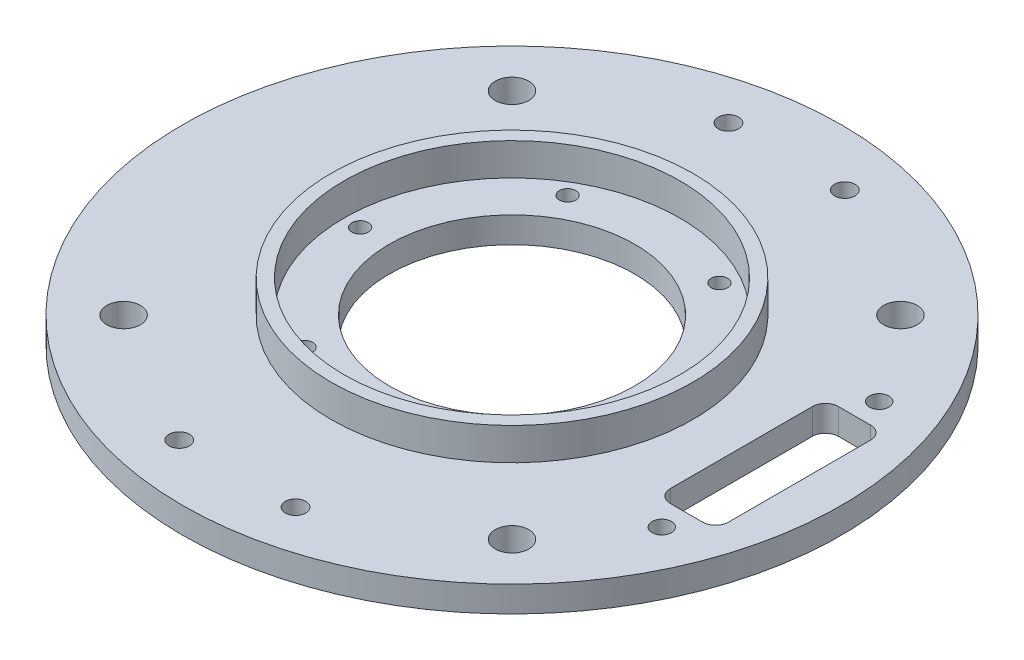
ISO-10303-21;
HEADER;
FILE_DESCRIPTION(('STEP AP214'),'2;1');
FILE_NAME('part.step','',(''),(''),'','','');
FILE_SCHEMA(('AUTOMOTIVE_DESIGN { 1 0 10303 214 1 1 1 1 }'));
ENDSEC;
DATA;
#1=APPLICATION_CONTEXT('core data for automotive mechanical design processes');
#2=APPLICATION_PROTOCOL_DEFINITION('international standard','automotive_design',2000,#1);
#3=PRODUCT_CONTEXT('',#1,'mechanical');
#4=PRODUCT('Part','Part','',(#3));
#5=PRODUCT_RELATED_PRODUCT_CATEGORY('part','',(#4));
#6=PRODUCT_DEFINITION_FORMATION('','',#4);
#7=PRODUCT_DEFINITION_CONTEXT('part definition',#1,'design');
#8=PRODUCT_DEFINITION('design','',#6,#7);
#9=PRODUCT_DEFINITION_SHAPE('','',#8);
#10=(LENGTH_UNIT() NAMED_UNIT(*) SI_UNIT(.MILLI.,.METRE.));
#11=(NAMED_UNIT(*) PLANE_ANGLE_UNIT() SI_UNIT($,.RADIAN.));
#12=(NAMED_UNIT(*) SI_UNIT($,.STERADIAN.) SOLID_ANGLE_UNIT());
#13=UNCERTAINTY_MEASURE_WITH_UNIT(LENGTH_MEASURE(1.E-05),#10,'distance_accuracy_value','');
#14=(GEOMETRIC_REPRESENTATION_CONTEXT(3) GLOBAL_UNCERTAINTY_ASSIGNED_CONTEXT((#13)) GLOBAL_UNIT_ASSIGNED_CONTEXT((#10,
#11,#12)) REPRESENTATION_CONTEXT('',''));
#15=CARTESIAN_POINT('',(0.,0.,0.));
#16=DIRECTION('',(0.,0.,1.));
#17=DIRECTION('',(1.,0.,0.));
#18=AXIS2_PLACEMENT_3D('',#15,#16,#17);
#19=CARTESIAN_POINT('',(0.,4.,0.));
#20=DIRECTION('',(0.,1.,0.));
#21=DIRECTION('',(0.,0.,1.));
#22=AXIS2_PLACEMENT_3D('',#19,#20,#21);
#23=PLANE('',#22);
#24=CARTESIAN_POINT('',(0.,4.,0.));
#25=DIRECTION('',(0.,1.,0.));
#26=DIRECTION('',(0.,0.,1.));
#27=AXIS2_PLACEMENT_3D('',#24,#25,#26);
#28=CIRCLE('',#27,19.);
#29=CARTESIAN_POINT('',(0.,4.,19.));
#30=VERTEX_POINT('',#29);
#31=EDGE_CURVE('E213',#30,#30,#28,.T.);
#32=ORIENTED_EDGE('',*,*,#31,.F.);
#33=EDGE_LOOP('',(#32));
#34=FACE_BOUND('',#33,.T.);
#35=CARTESIAN_POINT('',(23.5,4.,0.));
#36=DIRECTION('',(0.,1.,0.));
#37=DIRECTION('',(0.,0.,1.));
#38=AXIS2_PLACEMENT_3D('',#35,#36,#37);
#39=CIRCLE('',#38,1.275);
#40=CARTESIAN_POINT('',(23.5,4.,1.275));
#41=VERTEX_POINT('',#40);
#42=EDGE_CURVE('E206',#41,#41,#39,.T.);
#43=ORIENTED_EDGE('',*,*,#42,.F.);
#44=EDGE_LOOP('',(#43));
#45=FACE_BOUND('',#44,.T.);
#46=CARTESIAN_POINT('',(11.75,4.,-20.3515969889343));
#47=DIRECTION('',(0.,1.,0.));
#48=DIRECTION('',(0.,0.,1.));
#49=AXIS2_PLACEMENT_3D('',#46,#47,#48);
#50=CIRCLE('',#49,1.275);
#51=CARTESIAN_POINT('',(11.75,4.,-19.0765969889343));
#52=VERTEX_POINT('',#51);
#53=EDGE_CURVE('E202',#52,#52,#50,.T.);
#54=ORIENTED_EDGE('',*,*,#53,.F.);
#55=EDGE_LOOP('',(#54));
#56=FACE_BOUND('',#55,.T.);
#57=CARTESIAN_POINT('',(-11.7500000000001,4.,-20.3515969889343));
#58=DIRECTION('',(0.,1.,0.));
#59=DIRECTION('',(0.,0.,1.));
#60=AXIS2_PLACEMENT_3D('',#57,#58,#59);
#61=CIRCLE('',#60,1.275);
#62=CARTESIAN_POINT('',(-11.7500000000001,4.,-19.0765969889343));
#63=VERTEX_POINT('',#62);
#64=EDGE_CURVE('E196',#63,#63,#61,.T.);
#65=ORIENTED_EDGE('',*,*,#64,.F.);
#66=EDGE_LOOP('',(#65));
#67=FACE_BOUND('',#66,.T.);
#68=CARTESIAN_POINT('',(-23.5,4.,0.));
#69=DIRECTION('',(0.,1.,0.));
#70=DIRECTION('',(0.,0.,1.));
#71=AXIS2_PLACEMENT_3D('',#68,#69,#70);
#72=CIRCLE('',#71,1.275);
#73=CARTESIAN_POINT('',(-23.5,4.,1.275));
#74=VERTEX_POINT('',#73);
#75=EDGE_CURVE('E190',#74,#74,#72,.T.);
#76=ORIENTED_EDGE('',*,*,#75,.F.);
#77=EDGE_LOOP('',(#76));
#78=FACE_BOUND('',#77,.T.);
#79=CARTESIAN_POINT('',(-11.7499999999998,4.,20.3515969889344));
#80=DIRECTION('',(0.,1.,0.));
#81=DIRECTION('',(0.,0.,1.));
#82=AXIS2_PLACEMENT_3D('',#79,#80,#81);
#83=CIRCLE('',#82,1.275);
#84=CARTESIAN_POINT('',(-11.7499999999998,4.,21.6265969889344));
#85=VERTEX_POINT('',#84);
#86=EDGE_CURVE('E184',#85,#85,#83,.T.);
#87=ORIENTED_EDGE('',*,*,#86,.F.);
#88=EDGE_LOOP('',(#87));
#89=FACE_BOUND('',#88,.T.);
#90=CARTESIAN_POINT('',(11.7500000000002,4.,20.3515969889342));
#91=DIRECTION('',(0.,1.,0.));
#92=DIRECTION('',(0.,0.,1.));
#93=AXIS2_PLACEMENT_3D('',#90,#91,#92);
#94=CIRCLE('',#93,1.275);
#95=CARTESIAN_POINT('',(11.7500000000002,4.,21.6265969889342));
#96=VERTEX_POINT('',#95);
#97=EDGE_CURVE('E178',#96,#96,#94,.T.);
#98=ORIENTED_EDGE('',*,*,#97,.F.);
#99=EDGE_LOOP('',(#98));
#100=FACE_BOUND('',#99,.T.);
#101=CARTESIAN_POINT('',(0.,4.,0.));
#102=DIRECTION('',(0.,1.,0.));
#103=DIRECTION('',(0.,0.,1.));
#104=AXIS2_PLACEMENT_3D('',#101,#102,#103);
#105=CIRCLE('',#104,26.);
#106=CARTESIAN_POINT('',(0.,4.,26.));
#107=VERTEX_POINT('',#106);
#108=EDGE_CURVE('E144',#107,#107,#105,.T.);
#109=ORIENTED_EDGE('',*,*,#108,.T.);
#110=EDGE_LOOP('',(#109));
#111=FACE_BOUND('',#110,.T.);
#112=ADVANCED_FACE('F35',(#34,#45,#56,#67,#78,#89,#100,#111),#23,.T.);
#113=CARTESIAN_POINT('',(-30.0520382004286,4.,30.0520382004279));
#114=DIRECTION('',(0.,1.,0.));
#115=DIRECTION('',(0.,0.,1.));
#116=AXIS2_PLACEMENT_3D('',#113,#114,#115);
#117=CIRCLE('',#116,2.6);
#118=CARTESIAN_POINT('',(-30.0520382004286,4.,32.6520382004279));
#119=VERTEX_POINT('',#118);
#120=EDGE_CURVE('E371',#119,#119,#117,.T.);
#121=ORIENTED_EDGE('',*,*,#120,.F.);
#122=EDGE_LOOP('',(#121));
#123=FACE_BOUND('',#122,.T.);
#124=CARTESIAN_POINT('',(30.0520382004282,4.,30.0520382004283));
#125=DIRECTION('',(0.,1.,0.));
#126=DIRECTION('',(0.,0.,1.));
#127=AXIS2_PLACEMENT_3D('',#124,#125,#126);
#128=CIRCLE('',#127,2.6);
#129=CARTESIAN_POINT('',(30.0520382004282,4.,32.6520382004283));
#130=VERTEX_POINT('',#129);
#131=EDGE_CURVE('E258',#130,#130,#128,.T.);
#132=ORIENTED_EDGE('',*,*,#131,.F.);
#133=EDGE_LOOP('',(#132));
#134=FACE_BOUND('',#133,.T.);
#135=CARTESIAN_POINT('',(30.0520382004284,4.,-30.0520382004281));
#136=DIRECTION('',(0.,1.,0.));
#137=DIRECTION('',(0.,0.,1.));
#138=AXIS2_PLACEMENT_3D('',#135,#136,#137);
#139=CIRCLE('',#138,2.6);
#140=CARTESIAN_POINT('',(30.0520382004284,4.,-27.4520382004281));
#141=VERTEX_POINT('',#140);
#142=EDGE_CURVE('E247',#141,#141,#139,.T.);
#143=ORIENTED_EDGE('',*,*,#142,.F.);
#144=EDGE_LOOP('',(#143));
#145=FACE_BOUND('',#144,.T.);
#146=CARTESIAN_POINT('',(-30.0520382004282,4.,-30.0520382004283));
#147=DIRECTION('',(0.,1.,0.));
#148=DIRECTION('',(0.,0.,1.));
#149=AXIS2_PLACEMENT_3D('',#146,#147,#148);
#150=CIRCLE('',#149,2.6);
#151=CARTESIAN_POINT('',(-30.0520382004282,4.,-27.4520382004283));
#152=VERTEX_POINT('',#151);
#153=EDGE_CURVE('E246',#152,#152,#150,.T.);
#154=ORIENTED_EDGE('',*,*,#153,.F.);
#155=EDGE_LOOP('',(#154));
#156=FACE_BOUND('',#155,.T.);
#157=CARTESIAN_POINT('',(40.,4.,16.82));
#158=DIRECTION('',(0.,1.,0.));
#159=DIRECTION('',(0.,0.,1.));
#160=AXIS2_PLACEMENT_3D('',#157,#158,#159);
#161=CIRCLE('',#160,1.5);
#162=CARTESIAN_POINT('',(40.,4.,18.32));
#163=VERTEX_POINT('',#162);
#164=EDGE_CURVE('E264',#163,#163,#161,.T.);
#165=ORIENTED_EDGE('',*,*,#164,.F.);
#166=EDGE_LOOP('',(#165));
#167=FACE_BOUND('',#166,.T.);
#168=CARTESIAN_POINT('',(40.,4.,-16.82));
#169=DIRECTION('',(0.,1.,0.));
#170=DIRECTION('',(0.,0.,1.));
#171=AXIS2_PLACEMENT_3D('',#168,#169,#170);
#172=CIRCLE('',#171,1.5);
#173=CARTESIAN_POINT('',(40.,4.,-15.32));
#174=VERTEX_POINT('',#173);
#175=EDGE_CURVE('E268',#174,#174,#172,.T.);
#176=ORIENTED_EDGE('',*,*,#175,.F.);
#177=EDGE_LOOP('',(#176));
#178=FACE_BOUND('',#177,.T.);
#179=DIRECTION('',(0.,0.,1.));
#180=VECTOR('',#179,1.);
#181=CARTESIAN_POINT('',(35.5,4.,13.));
#182=LINE('',#181,#180);
#183=CARTESIAN_POINT('',(35.5,4.,-11.));
#184=VERTEX_POINT('',#183);
#185=CARTESIAN_POINT('',(35.5,4.,11.));
#186=VERTEX_POINT('',#185);
#187=EDGE_CURVE('E136',#184,#186,#182,.T.);
#188=ORIENTED_EDGE('',*,*,#187,.F.);
#189=CARTESIAN_POINT('',(37.5,4.,-11.));
#190=DIRECTION('',(0.,1.,0.));
#191=DIRECTION('',(0.,0.,1.));
#192=AXIS2_PLACEMENT_3D('',#189,#190,#191);
#193=CIRCLE('',#192,2.);
#194=CARTESIAN_POINT('',(37.5,4.,-13.));
#195=VERTEX_POINT('',#194);
#196=EDGE_CURVE('E44',#184,#195,#193,.F.);
#197=ORIENTED_EDGE('',*,*,#196,.T.);
#198=DIRECTION('',(-1.,0.,0.));
#199=VECTOR('',#198,1.);
#200=CARTESIAN_POINT('',(44.5,4.,-13.));
#201=LINE('',#200,#199);
#202=CARTESIAN_POINT('',(42.5,4.,-13.));
#203=VERTEX_POINT('',#202);
#204=EDGE_CURVE('E131',#203,#195,#201,.T.);
#205=ORIENTED_EDGE('',*,*,#204,.F.);
#206=CARTESIAN_POINT('',(42.5,4.,-11.));
#207=DIRECTION('',(0.,1.,0.));
#208=DIRECTION('',(0.,0.,1.));
#209=AXIS2_PLACEMENT_3D('',#206,#207,#208);
#210=CIRCLE('',#209,2.);
#211=CARTESIAN_POINT('',(44.5,4.,-11.));
#212=VERTEX_POINT('',#211);
#213=EDGE_CURVE('E130',#203,#212,#210,.F.);
#214=ORIENTED_EDGE('',*,*,#213,.T.);
#215=DIRECTION('',(0.,0.,-1.));
#216=VECTOR('',#215,1.);
#217=CARTESIAN_POINT('',(44.5,4.,13.));
#218=LINE('',#217,#216);
#219=CARTESIAN_POINT('',(44.5,4.,11.));
#220=VERTEX_POINT('',#219);
#221=EDGE_CURVE('E120',#220,#212,#218,.T.);
#222=ORIENTED_EDGE('',*,*,#221,.F.);
#223=CARTESIAN_POINT('',(42.5,4.,11.));
#224=DIRECTION('',(0.,1.,0.));
#225=DIRECTION('',(0.,0.,1.));
#226=AXIS2_PLACEMENT_3D('',#223,#224,#225);
#227=CIRCLE('',#226,2.);
#228=CARTESIAN_POINT('',(42.5,4.,13.));
#229=VERTEX_POINT('',#228);
#230=EDGE_CURVE('E103',#220,#229,#227,.F.);
#231=ORIENTED_EDGE('',*,*,#230,.T.);
#232=DIRECTION('',(1.,0.,0.));
#233=VECTOR('',#232,1.);
#234=CARTESIAN_POINT('',(44.5,4.,13.));
#235=LINE('',#234,#233);
#236=CARTESIAN_POINT('',(37.5,4.,13.));
#237=VERTEX_POINT('',#236);
#238=EDGE_CURVE('E132',#237,#229,#235,.T.);
#239=ORIENTED_EDGE('',*,*,#238,.F.);
#240=CARTESIAN_POINT('',(37.5,4.,11.));
#241=DIRECTION('',(0.,1.,0.));
#242=DIRECTION('',(0.,0.,1.));
#243=AXIS2_PLACEMENT_3D('',#240,#241,#242);
#244=CIRCLE('',#243,2.);
#245=EDGE_CURVE('E238',#237,#186,#244,.F.);
#246=ORIENTED_EDGE('',*,*,#245,.T.);
#247=EDGE_LOOP('',(#188,#197,#205,#214,#222,#231,#239,#246));
#248=FACE_BOUND('',#247,.T.);
#249=CARTESIAN_POINT('',(0.,4.,0.));
#250=DIRECTION('',(0.,1.,0.));
#251=DIRECTION('',(0.,0.,1.));
#252=AXIS2_PLACEMENT_3D('',#249,#250,#251);
#253=CIRCLE('',#252,28.);
#254=CARTESIAN_POINT('',(0.,4.,28.));
#255=VERTEX_POINT('',#254);
#256=EDGE_CURVE('E151',#255,#255,#253,.T.);
#257=ORIENTED_EDGE('',*,*,#256,.F.);
#258=EDGE_LOOP('',(#257));
#259=FACE_BOUND('',#258,.T.);
#260=CARTESIAN_POINT('',(-9.00000000000001,4.,-42.5));
#261=DIRECTION('',(0.,-1.,0.));
#262=DIRECTION('',(0.,0.,-1.));
#263=AXIS2_PLACEMENT_3D('',#260,#261,#262);
#264=CIRCLE('',#263,1.575);
#265=CARTESIAN_POINT('',(-9.00000000000001,4.,-44.075));
#266=VERTEX_POINT('',#265);
#267=EDGE_CURVE('E157',#266,#266,#264,.T.);
#268=ORIENTED_EDGE('',*,*,#267,.T.);
#269=EDGE_LOOP('',(#268));
#270=FACE_BOUND('',#269,.T.);
#271=CARTESIAN_POINT('',(-9.00000000000001,4.,42.5));
#272=DIRECTION('',(0.,-1.,0.));
#273=DIRECTION('',(0.,0.,-1.));
#274=AXIS2_PLACEMENT_3D('',#271,#272,#273);
#275=CIRCLE('',#274,1.575);
#276=CARTESIAN_POINT('',(-9.00000000000001,4.,40.925));
#277=VERTEX_POINT('',#276);
#278=EDGE_CURVE('E163',#277,#277,#275,.T.);
#279=ORIENTED_EDGE('',*,*,#278,.T.);
#280=EDGE_LOOP('',(#279));
#281=FACE_BOUND('',#280,.T.);
#282=CARTESIAN_POINT('',(8.99999999999999,4.,-42.5));
#283=DIRECTION('',(0.,-1.,0.));
#284=DIRECTION('',(0.,0.,-1.));
#285=AXIS2_PLACEMENT_3D('',#282,#283,#284);
#286=CIRCLE('',#285,1.575);
#287=CARTESIAN_POINT('',(8.99999999999999,4.,-44.075));
#288=VERTEX_POINT('',#287);
#289=EDGE_CURVE('E169',#288,#288,#286,.T.);
#290=ORIENTED_EDGE('',*,*,#289,.T.);
#291=EDGE_LOOP('',(#290));
#292=FACE_BOUND('',#291,.T.);
#293=CARTESIAN_POINT('',(8.99999999999999,4.,42.5));
#294=DIRECTION('',(0.,-1.,0.));
#295=DIRECTION('',(0.,0.,-1.));
#296=AXIS2_PLACEMENT_3D('',#293,#294,#295);
#297=CIRCLE('',#296,1.575);
#298=CARTESIAN_POINT('',(8.99999999999999,4.,40.925));
#299=VERTEX_POINT('',#298);
#300=EDGE_CURVE('E175',#299,#299,#297,.T.);
#301=ORIENTED_EDGE('',*,*,#300,.T.);
#302=EDGE_LOOP('',(#301));
#303=FACE_BOUND('',#302,.T.);
#304=CARTESIAN_POINT('',(0.,4.,0.));
#305=DIRECTION('',(0.,1.,0.));
#306=DIRECTION('',(0.,0.,1.));
#307=AXIS2_PLACEMENT_3D('',#304,#305,#306);
#308=CIRCLE('',#307,51.);
#309=CARTESIAN_POINT('',(0.,4.,51.));
#310=VERTEX_POINT('',#309);
#311=EDGE_CURVE('E154',#310,#310,#308,.T.);
#312=ORIENTED_EDGE('',*,*,#311,.T.);
#313=EDGE_LOOP('',(#312));
#314=FACE_BOUND('',#313,.T.);
#315=ADVANCED_FACE('F127',(#123,#134,#145,#156,#167,#178,#248,#259,#270,#281,#292,#303,#314),
#23,.T.);
#316=CARTESIAN_POINT('',(0.,0.,0.));
#317=DIRECTION('',(0.,1.,0.));
#318=DIRECTION('',(0.,0.,1.));
#319=AXIS2_PLACEMENT_3D('',#316,#317,#318);
#320=PLANE('',#319);
#321=CARTESIAN_POINT('',(-30.0520382004286,0.,30.0520382004279));
#322=DIRECTION('',(0.,1.,0.));
#323=DIRECTION('',(0.,0.,1.));
#324=AXIS2_PLACEMENT_3D('',#321,#322,#323);
#325=CIRCLE('',#324,2.6);
#326=CARTESIAN_POINT('',(-30.0520382004286,0.,32.6520382004279));
#327=VERTEX_POINT('',#326);
#328=EDGE_CURVE('E374',#327,#327,#325,.T.);
#329=ORIENTED_EDGE('',*,*,#328,.T.);
#330=EDGE_LOOP('',(#329));
#331=FACE_BOUND('',#330,.T.);
#332=CARTESIAN_POINT('',(30.0520382004282,0.,30.0520382004283));
#333=DIRECTION('',(0.,1.,0.));
#334=DIRECTION('',(0.,0.,1.));
#335=AXIS2_PLACEMENT_3D('',#332,#333,#334);
#336=CIRCLE('',#335,2.6);
#337=CARTESIAN_POINT('',(30.0520382004282,0.,32.6520382004283));
#338=VERTEX_POINT('',#337);
#339=EDGE_CURVE('E39',#338,#338,#336,.T.);
#340=ORIENTED_EDGE('',*,*,#339,.T.);
#341=EDGE_LOOP('',(#340));
#342=FACE_BOUND('',#341,.T.);
#343=CARTESIAN_POINT('',(30.0520382004284,0.,-30.0520382004281));
#344=DIRECTION('',(0.,1.,0.));
#345=DIRECTION('',(0.,0.,1.));
#346=AXIS2_PLACEMENT_3D('',#343,#344,#345);
#347=CIRCLE('',#346,2.6);
#348=CARTESIAN_POINT('',(30.0520382004284,0.,-27.4520382004281));
#349=VERTEX_POINT('',#348);
#350=EDGE_CURVE('E244',#349,#349,#347,.T.);
#351=ORIENTED_EDGE('',*,*,#350,.T.);
#352=EDGE_LOOP('',(#351));
#353=FACE_BOUND('',#352,.T.);
#354=CARTESIAN_POINT('',(-30.0520382004282,0.,-30.0520382004283));
#355=DIRECTION('',(0.,1.,0.));
#356=DIRECTION('',(0.,0.,1.));
#357=AXIS2_PLACEMENT_3D('',#354,#355,#356);
#358=CIRCLE('',#357,2.6);
#359=CARTESIAN_POINT('',(-30.0520382004282,0.,-27.4520382004283));
#360=VERTEX_POINT('',#359);
#361=EDGE_CURVE('E251',#360,#360,#358,.T.);
#362=ORIENTED_EDGE('',*,*,#361,.T.);
#363=EDGE_LOOP('',(#362));
#364=FACE_BOUND('',#363,.T.);
#365=CARTESIAN_POINT('',(40.,0.,16.82));
#366=DIRECTION('',(0.,1.,0.));
#367=DIRECTION('',(0.,0.,1.));
#368=AXIS2_PLACEMENT_3D('',#365,#366,#367);
#369=CIRCLE('',#368,1.5);
#370=CARTESIAN_POINT('',(40.,0.,18.32));
#371=VERTEX_POINT('',#370);
#372=EDGE_CURVE('E271',#371,#371,#369,.T.);
#373=ORIENTED_EDGE('',*,*,#372,.T.);
#374=EDGE_LOOP('',(#373));
#375=FACE_BOUND('',#374,.T.);
#376=CARTESIAN_POINT('',(40.,0.,-16.82));
#377=DIRECTION('',(0.,1.,0.));
#378=DIRECTION('',(0.,0.,1.));
#379=AXIS2_PLACEMENT_3D('',#376,#377,#378);
#380=CIRCLE('',#379,1.5);
#381=CARTESIAN_POINT('',(40.,0.,-15.32));
#382=VERTEX_POINT('',#381);
#383=EDGE_CURVE('E265',#382,#382,#380,.T.);
#384=ORIENTED_EDGE('',*,*,#383,.T.);
#385=EDGE_LOOP('',(#384));
#386=FACE_BOUND('',#385,.T.);
#387=DIRECTION('',(0.,0.,-1.));
#388=VECTOR('',#387,1.);
#389=CARTESIAN_POINT('',(44.5,0.,13.));
#390=LINE('',#389,#388);
#391=CARTESIAN_POINT('',(44.5,0.,11.));
#392=VERTEX_POINT('',#391);
#393=CARTESIAN_POINT('',(44.5,0.,-11.));
#394=VERTEX_POINT('',#393);
#395=EDGE_CURVE('E122',#392,#394,#390,.T.);
#396=ORIENTED_EDGE('',*,*,#395,.T.);
#397=CARTESIAN_POINT('',(42.5,0.,-11.));
#398=DIRECTION('',(0.,1.,0.));
#399=DIRECTION('',(0.,0.,1.));
#400=AXIS2_PLACEMENT_3D('',#397,#398,#399);
#401=CIRCLE('',#400,2.);
#402=CARTESIAN_POINT('',(42.5,0.,-13.));
#403=VERTEX_POINT('',#402);
#404=EDGE_CURVE('E59',#394,#403,#401,.T.);
#405=ORIENTED_EDGE('',*,*,#404,.T.);
#406=DIRECTION('',(-1.,0.,0.));
#407=VECTOR('',#406,1.);
#408=CARTESIAN_POINT('',(44.5,0.,-13.));
#409=LINE('',#408,#407);
#410=CARTESIAN_POINT('',(37.5,0.,-13.));
#411=VERTEX_POINT('',#410);
#412=EDGE_CURVE('E147',#403,#411,#409,.T.);
#413=ORIENTED_EDGE('',*,*,#412,.T.);
#414=CARTESIAN_POINT('',(37.5,0.,-11.));
#415=DIRECTION('',(0.,1.,0.));
#416=DIRECTION('',(0.,0.,1.));
#417=AXIS2_PLACEMENT_3D('',#414,#415,#416);
#418=CIRCLE('',#417,2.);
#419=CARTESIAN_POINT('',(35.5,0.,-11.));
#420=VERTEX_POINT('',#419);
#421=EDGE_CURVE('E11',#411,#420,#418,.T.);
#422=ORIENTED_EDGE('',*,*,#421,.T.);
#423=DIRECTION('',(0.,0.,1.));
#424=VECTOR('',#423,1.);
#425=CARTESIAN_POINT('',(35.5,0.,13.));
#426=LINE('',#425,#424);
#427=CARTESIAN_POINT('',(35.5,0.,11.));
#428=VERTEX_POINT('',#427);
#429=EDGE_CURVE('E134',#420,#428,#426,.T.);
#430=ORIENTED_EDGE('',*,*,#429,.T.);
#431=CARTESIAN_POINT('',(37.5,0.,11.));
#432=DIRECTION('',(0.,1.,0.));
#433=DIRECTION('',(0.,0.,1.));
#434=AXIS2_PLACEMENT_3D('',#431,#432,#433);
#435=CIRCLE('',#434,2.);
#436=CARTESIAN_POINT('',(37.5,0.,13.));
#437=VERTEX_POINT('',#436);
#438=EDGE_CURVE('E240',#428,#437,#435,.T.);
#439=ORIENTED_EDGE('',*,*,#438,.T.);
#440=DIRECTION('',(1.,0.,0.));
#441=VECTOR('',#440,1.);
#442=CARTESIAN_POINT('',(44.5,0.,13.));
#443=LINE('',#442,#441);
#444=CARTESIAN_POINT('',(42.5,0.,13.));
#445=VERTEX_POINT('',#444);
#446=EDGE_CURVE('E278',#437,#445,#443,.T.);
#447=ORIENTED_EDGE('',*,*,#446,.T.);
#448=CARTESIAN_POINT('',(42.5,0.,11.));
#449=DIRECTION('',(0.,1.,0.));
#450=DIRECTION('',(0.,0.,1.));
#451=AXIS2_PLACEMENT_3D('',#448,#449,#450);
#452=CIRCLE('',#451,2.);
#453=EDGE_CURVE('E113',#445,#392,#452,.T.);
#454=ORIENTED_EDGE('',*,*,#453,.T.);
#455=EDGE_LOOP('',(#396,#405,#413,#422,#430,#439,#447,#454));
#456=FACE_BOUND('',#455,.T.);
#457=CARTESIAN_POINT('',(-9.00000000000001,0.,-42.5));
#458=DIRECTION('',(0.,-1.,0.));
#459=DIRECTION('',(0.,0.,-1.));
#460=AXIS2_PLACEMENT_3D('',#457,#458,#459);
#461=CIRCLE('',#460,1.57499999999999);
#462=CARTESIAN_POINT('',(-9.00000000000001,0.,-44.075));
#463=VERTEX_POINT('',#462);
#464=EDGE_CURVE('E150',#463,#463,#461,.T.);
#465=ORIENTED_EDGE('',*,*,#464,.F.);
#466=EDGE_LOOP('',(#465));
#467=FACE_BOUND('',#466,.T.);
#468=CARTESIAN_POINT('',(-9.00000000000001,0.,42.5));
#469=DIRECTION('',(0.,-1.,0.));
#470=DIRECTION('',(0.,0.,-1.));
#471=AXIS2_PLACEMENT_3D('',#468,#469,#470);
#472=CIRCLE('',#471,1.57499999999999);
#473=CARTESIAN_POINT('',(-9.00000000000001,0.,40.925));
#474=VERTEX_POINT('',#473);
#475=EDGE_CURVE('E160',#474,#474,#472,.T.);
#476=ORIENTED_EDGE('',*,*,#475,.F.);
#477=EDGE_LOOP('',(#476));
#478=FACE_BOUND('',#477,.T.);
#479=CARTESIAN_POINT('',(8.99999999999999,0.,-42.5));
#480=DIRECTION('',(0.,-1.,0.));
#481=DIRECTION('',(0.,0.,-1.));
#482=AXIS2_PLACEMENT_3D('',#479,#480,#481);
#483=CIRCLE('',#482,1.57499999999999);
#484=CARTESIAN_POINT('',(8.99999999999999,0.,-44.075));
#485=VERTEX_POINT('',#484);
#486=EDGE_CURVE('E166',#485,#485,#483,.T.);
#487=ORIENTED_EDGE('',*,*,#486,.F.);
#488=EDGE_LOOP('',(#487));
#489=FACE_BOUND('',#488,.T.);
#490=CARTESIAN_POINT('',(8.99999999999999,0.,42.5));
#491=DIRECTION('',(0.,-1.,0.));
#492=DIRECTION('',(0.,0.,-1.));
#493=AXIS2_PLACEMENT_3D('',#490,#491,#492);
#494=CIRCLE('',#493,1.57499999999999);
#495=CARTESIAN_POINT('',(8.99999999999999,0.,40.925));
#496=VERTEX_POINT('',#495);
#497=EDGE_CURVE('E172',#496,#496,#494,.T.);
#498=ORIENTED_EDGE('',*,*,#497,.F.);
#499=EDGE_LOOP('',(#498));
#500=FACE_BOUND('',#499,.T.);
#501=CARTESIAN_POINT('',(11.7500000000002,0.,20.3515969889342));
#502=DIRECTION('',(0.,1.,0.));
#503=DIRECTION('',(0.,0.,1.));
#504=AXIS2_PLACEMENT_3D('',#501,#502,#503);
#505=CIRCLE('',#504,1.275);
#506=CARTESIAN_POINT('',(11.7500000000002,0.,21.6265969889342));
#507=VERTEX_POINT('',#506);
#508=EDGE_CURVE('E181',#507,#507,#505,.T.);
#509=ORIENTED_EDGE('',*,*,#508,.T.);
#510=EDGE_LOOP('',(#509));
#511=FACE_BOUND('',#510,.T.);
#512=CARTESIAN_POINT('',(-11.7499999999998,0.,20.3515969889344));
#513=DIRECTION('',(0.,1.,0.));
#514=DIRECTION('',(0.,0.,1.));
#515=AXIS2_PLACEMENT_3D('',#512,#513,#514);
#516=CIRCLE('',#515,1.275);
#517=CARTESIAN_POINT('',(-11.7499999999998,0.,21.6265969889344));
#518=VERTEX_POINT('',#517);
#519=EDGE_CURVE('E187',#518,#518,#516,.T.);
#520=ORIENTED_EDGE('',*,*,#519,.T.);
#521=EDGE_LOOP('',(#520));
#522=FACE_BOUND('',#521,.T.);
#523=CARTESIAN_POINT('',(-23.5,0.,0.));
#524=DIRECTION('',(0.,1.,0.));
#525=DIRECTION('',(0.,0.,1.));
#526=AXIS2_PLACEMENT_3D('',#523,#524,#525);
#527=CIRCLE('',#526,1.275);
#528=CARTESIAN_POINT('',(-23.5,0.,1.275));
#529=VERTEX_POINT('',#528);
#530=EDGE_CURVE('E193',#529,#529,#527,.T.);
#531=ORIENTED_EDGE('',*,*,#530,.T.);
#532=EDGE_LOOP('',(#531));
#533=FACE_BOUND('',#532,.T.);
#534=CARTESIAN_POINT('',(-11.7500000000001,0.,-20.3515969889343));
#535=DIRECTION('',(0.,1.,0.));
#536=DIRECTION('',(0.,0.,1.));
#537=AXIS2_PLACEMENT_3D('',#534,#535,#536);
#538=CIRCLE('',#537,1.275);
#539=CARTESIAN_POINT('',(-11.7500000000001,0.,-19.0765969889343));
#540=VERTEX_POINT('',#539);
#541=EDGE_CURVE('E199',#540,#540,#538,.T.);
#542=ORIENTED_EDGE('',*,*,#541,.T.);
#543=EDGE_LOOP('',(#542));
#544=FACE_BOUND('',#543,.T.);
#545=CARTESIAN_POINT('',(11.75,0.,-20.3515969889343));
#546=DIRECTION('',(0.,1.,0.));
#547=DIRECTION('',(0.,0.,1.));
#548=AXIS2_PLACEMENT_3D('',#545,#546,#547);
#549=CIRCLE('',#548,1.275);
#550=CARTESIAN_POINT('',(11.75,0.,-19.0765969889343));
#551=VERTEX_POINT('',#550);
#552=EDGE_CURVE('E205',#551,#551,#549,.T.);
#553=ORIENTED_EDGE('',*,*,#552,.T.);
#554=EDGE_LOOP('',(#553));
#555=FACE_BOUND('',#554,.T.);
#556=CARTESIAN_POINT('',(23.5,0.,0.));
#557=DIRECTION('',(0.,1.,0.));
#558=DIRECTION('',(0.,0.,1.));
#559=AXIS2_PLACEMENT_3D('',#556,#557,#558);
#560=CIRCLE('',#559,1.275);
#561=CARTESIAN_POINT('',(23.5,0.,1.275));
#562=VERTEX_POINT('',#561);
#563=EDGE_CURVE('E209',#562,#562,#560,.T.);
#564=ORIENTED_EDGE('',*,*,#563,.T.);
#565=EDGE_LOOP('',(#564));
#566=FACE_BOUND('',#565,.T.);
#567=CARTESIAN_POINT('',(0.,0.,0.));
#568=DIRECTION('',(0.,1.,0.));
#569=DIRECTION('',(0.,0.,1.));
#570=AXIS2_PLACEMENT_3D('',#567,#568,#569);
#571=CIRCLE('',#570,51.);
#572=CARTESIAN_POINT('',(0.,0.,51.));
#573=VERTEX_POINT('',#572);
#574=EDGE_CURVE('E216',#573,#573,#571,.T.);
#575=ORIENTED_EDGE('',*,*,#574,.F.);
#576=EDGE_LOOP('',(#575));
#577=FACE_BOUND('',#576,.T.);
#578=CARTESIAN_POINT('',(0.,0.,0.));
#579=DIRECTION('',(0.,1.,0.));
#580=DIRECTION('',(0.,0.,1.));
#581=AXIS2_PLACEMENT_3D('',#578,#579,#580);
#582=CIRCLE('',#581,19.);
#583=CARTESIAN_POINT('',(0.,0.,19.));
#584=VERTEX_POINT('',#583);
#585=EDGE_CURVE('E212',#584,#584,#582,.T.);
#586=ORIENTED_EDGE('',*,*,#585,.T.);
#587=EDGE_LOOP('',(#586));
#588=FACE_BOUND('',#587,.T.);
#589=ADVANCED_FACE('F293',(#331,#342,#353,#364,#375,#386,#456,#467,#478,#489,#500,#511,#522,
#533,#544,#555,#566,#577,#588),#320,.F.);
#590=CARTESIAN_POINT('',(0.,4.,0.));
#591=DIRECTION('',(0.,-1.,0.));
#592=DIRECTION('',(0.,0.,-1.));
#593=AXIS2_PLACEMENT_3D('',#590,#591,#592);
#594=CYLINDRICAL_SURFACE('',#593,51.);
#595=ORIENTED_EDGE('',*,*,#311,.F.);
#596=EDGE_LOOP('',(#595));
#597=FACE_BOUND('',#596,.T.);
#598=ORIENTED_EDGE('',*,*,#574,.T.);
#599=EDGE_LOOP('',(#598));
#600=FACE_BOUND('',#599,.T.);
#601=ADVANCED_FACE('F325',(#597,#600),#594,.T.);
#602=CARTESIAN_POINT('',(0.,4.,0.));
#603=DIRECTION('',(0.,-1.,0.));
#604=DIRECTION('',(0.,0.,-1.));
#605=AXIS2_PLACEMENT_3D('',#602,#603,#604);
#606=CYLINDRICAL_SURFACE('',#605,19.);
#607=ORIENTED_EDGE('',*,*,#31,.T.);
#608=EDGE_LOOP('',(#607));
#609=FACE_BOUND('',#608,.T.);
#610=ORIENTED_EDGE('',*,*,#585,.F.);
#611=EDGE_LOOP('',(#610));
#612=FACE_BOUND('',#611,.T.);
#613=ADVANCED_FACE('F321',(#609,#612),#606,.F.);
#614=CARTESIAN_POINT('',(23.5,4.,0.));
#615=DIRECTION('',(0.,1.,0.));
#616=DIRECTION('',(0.,0.,1.));
#617=AXIS2_PLACEMENT_3D('',#614,#615,#616);
#618=CYLINDRICAL_SURFACE('',#617,1.275);
#619=ORIENTED_EDGE('',*,*,#42,.T.);
#620=EDGE_LOOP('',(#619));
#621=FACE_BOUND('',#620,.T.);
#622=ORIENTED_EDGE('',*,*,#563,.F.);
#623=EDGE_LOOP('',(#622));
#624=FACE_BOUND('',#623,.T.);
#625=ADVANCED_FACE('F587',(#621,#624),#618,.F.);
#626=CARTESIAN_POINT('',(11.75,4.,-20.3515969889343));
#627=DIRECTION('',(0.,1.,0.));
#628=DIRECTION('',(0.,0.,1.));
#629=AXIS2_PLACEMENT_3D('',#626,#627,#628);
#630=CYLINDRICAL_SURFACE('',#629,1.275);
#631=ORIENTED_EDGE('',*,*,#53,.T.);
#632=EDGE_LOOP('',(#631));
#633=FACE_BOUND('',#632,.T.);
#634=ORIENTED_EDGE('',*,*,#552,.F.);
#635=EDGE_LOOP('',(#634));
#636=FACE_BOUND('',#635,.T.);
#637=ADVANCED_FACE('F577',(#633,#636),#630,.F.);
#638=CARTESIAN_POINT('',(-11.7500000000001,4.,-20.3515969889343));
#639=DIRECTION('',(0.,1.,0.));
#640=DIRECTION('',(0.,0.,1.));
#641=AXIS2_PLACEMENT_3D('',#638,#639,#640);
#642=CYLINDRICAL_SURFACE('',#641,1.275);
#643=ORIENTED_EDGE('',*,*,#64,.T.);
#644=EDGE_LOOP('',(#643));
#645=FACE_BOUND('',#644,.T.);
#646=ORIENTED_EDGE('',*,*,#541,.F.);
#647=EDGE_LOOP('',(#646));
#648=FACE_BOUND('',#647,.T.);
#649=ADVANCED_FACE('F567',(#645,#648),#642,.F.);
#650=CARTESIAN_POINT('',(-23.5,4.,0.));
#651=DIRECTION('',(0.,1.,0.));
#652=DIRECTION('',(0.,0.,1.));
#653=AXIS2_PLACEMENT_3D('',#650,#651,#652);
#654=CYLINDRICAL_SURFACE('',#653,1.275);
#655=ORIENTED_EDGE('',*,*,#75,.T.);
#656=EDGE_LOOP('',(#655));
#657=FACE_BOUND('',#656,.T.);
#658=ORIENTED_EDGE('',*,*,#530,.F.);
#659=EDGE_LOOP('',(#658));
#660=FACE_BOUND('',#659,.T.);
#661=ADVANCED_FACE('F557',(#657,#660),#654,.F.);
#662=CARTESIAN_POINT('',(-11.7499999999998,4.,20.3515969889344));
#663=DIRECTION('',(0.,1.,0.));
#664=DIRECTION('',(0.,0.,1.));
#665=AXIS2_PLACEMENT_3D('',#662,#663,#664);
#666=CYLINDRICAL_SURFACE('',#665,1.275);
#667=ORIENTED_EDGE('',*,*,#86,.T.);
#668=EDGE_LOOP('',(#667));
#669=FACE_BOUND('',#668,.T.);
#670=ORIENTED_EDGE('',*,*,#519,.F.);
#671=EDGE_LOOP('',(#670));
#672=FACE_BOUND('',#671,.T.);
#673=ADVANCED_FACE('F547',(#669,#672),#666,.F.);
#674=CARTESIAN_POINT('',(11.7500000000002,4.,20.3515969889342));
#675=DIRECTION('',(0.,1.,0.));
#676=DIRECTION('',(0.,0.,1.));
#677=AXIS2_PLACEMENT_3D('',#674,#675,#676);
#678=CYLINDRICAL_SURFACE('',#677,1.275);
#679=ORIENTED_EDGE('',*,*,#97,.T.);
#680=EDGE_LOOP('',(#679));
#681=FACE_BOUND('',#680,.T.);
#682=ORIENTED_EDGE('',*,*,#508,.F.);
#683=EDGE_LOOP('',(#682));
#684=FACE_BOUND('',#683,.T.);
#685=ADVANCED_FACE('F537',(#681,#684),#678,.F.);
#686=CARTESIAN_POINT('',(8.99999999999999,0.,42.5));
#687=DIRECTION('',(0.,-1.,0.));
#688=DIRECTION('',(0.,0.,-1.));
#689=AXIS2_PLACEMENT_3D('',#686,#687,#688);
#690=CYLINDRICAL_SURFACE('',#689,1.57499999999999);
#691=ORIENTED_EDGE('',*,*,#300,.F.);
#692=EDGE_LOOP('',(#691));
#693=FACE_BOUND('',#692,.T.);
#694=ORIENTED_EDGE('',*,*,#497,.T.);
#695=EDGE_LOOP('',(#694));
#696=FACE_BOUND('',#695,.T.);
#697=ADVANCED_FACE('F527',(#693,#696),#690,.F.);
#698=CARTESIAN_POINT('',(8.99999999999999,0.,-42.5));
#699=DIRECTION('',(0.,-1.,0.));
#700=DIRECTION('',(0.,0.,-1.));
#701=AXIS2_PLACEMENT_3D('',#698,#699,#700);
#702=CYLINDRICAL_SURFACE('',#701,1.57499999999999);
#703=ORIENTED_EDGE('',*,*,#289,.F.);
#704=EDGE_LOOP('',(#703));
#705=FACE_BOUND('',#704,.T.);
#706=ORIENTED_EDGE('',*,*,#486,.T.);
#707=EDGE_LOOP('',(#706));
#708=FACE_BOUND('',#707,.T.);
#709=ADVANCED_FACE('F517',(#705,#708),#702,.F.);
#710=CARTESIAN_POINT('',(-9.00000000000001,0.,42.5));
#711=DIRECTION('',(0.,-1.,0.));
#712=DIRECTION('',(0.,0.,-1.));
#713=AXIS2_PLACEMENT_3D('',#710,#711,#712);
#714=CYLINDRICAL_SURFACE('',#713,1.57499999999999);
#715=ORIENTED_EDGE('',*,*,#278,.F.);
#716=EDGE_LOOP('',(#715));
#717=FACE_BOUND('',#716,.T.);
#718=ORIENTED_EDGE('',*,*,#475,.T.);
#719=EDGE_LOOP('',(#718));
#720=FACE_BOUND('',#719,.T.);
#721=ADVANCED_FACE('F507',(#717,#720),#714,.F.);
#722=CARTESIAN_POINT('',(-9.00000000000001,0.,-42.5));
#723=DIRECTION('',(0.,-1.,0.));
#724=DIRECTION('',(0.,0.,-1.));
#725=AXIS2_PLACEMENT_3D('',#722,#723,#724);
#726=CYLINDRICAL_SURFACE('',#725,1.57499999999999);
#727=ORIENTED_EDGE('',*,*,#267,.F.);
#728=EDGE_LOOP('',(#727));
#729=FACE_BOUND('',#728,.T.);
#730=ORIENTED_EDGE('',*,*,#464,.T.);
#731=EDGE_LOOP('',(#730));
#732=FACE_BOUND('',#731,.T.);
#733=ADVANCED_FACE('F492',(#729,#732),#726,.F.);
#734=CARTESIAN_POINT('',(0.,9.,0.));
#735=DIRECTION('',(0.,1.,0.));
#736=DIRECTION('',(0.,0.,1.));
#737=AXIS2_PLACEMENT_3D('',#734,#735,#736);
#738=PLANE('',#737);
#739=CARTESIAN_POINT('',(0.,9.,0.));
#740=DIRECTION('',(0.,1.,0.));
#741=DIRECTION('',(0.,0.,1.));
#742=AXIS2_PLACEMENT_3D('',#739,#740,#741);
#743=CIRCLE('',#742,28.);
#744=CARTESIAN_POINT('',(0.,9.,28.));
#745=VERTEX_POINT('',#744);
#746=EDGE_CURVE('E143',#745,#745,#743,.T.);
#747=ORIENTED_EDGE('',*,*,#746,.T.);
#748=EDGE_LOOP('',(#747));
#749=FACE_BOUND('',#748,.T.);
#750=CARTESIAN_POINT('',(0.,9.,0.));
#751=DIRECTION('',(0.,1.,0.));
#752=DIRECTION('',(0.,0.,1.));
#753=AXIS2_PLACEMENT_3D('',#750,#751,#752);
#754=CIRCLE('',#753,26.);
#755=CARTESIAN_POINT('',(0.,9.,26.));
#756=VERTEX_POINT('',#755);
#757=EDGE_CURVE('E140',#756,#756,#754,.T.);
#758=ORIENTED_EDGE('',*,*,#757,.F.);
#759=EDGE_LOOP('',(#758));
#760=FACE_BOUND('',#759,.T.);
#761=ADVANCED_FACE('F483',(#749,#760),#738,.T.);
#762=CARTESIAN_POINT('',(0.,9.,0.));
#763=DIRECTION('',(0.,-1.,0.));
#764=DIRECTION('',(0.,0.,-1.));
#765=AXIS2_PLACEMENT_3D('',#762,#763,#764);
#766=CYLINDRICAL_SURFACE('',#765,28.);
#767=ORIENTED_EDGE('',*,*,#746,.F.);
#768=EDGE_LOOP('',(#767));
#769=FACE_BOUND('',#768,.T.);
#770=ORIENTED_EDGE('',*,*,#256,.T.);
#771=EDGE_LOOP('',(#770));
#772=FACE_BOUND('',#771,.T.);
#773=ADVANCED_FACE('F473',(#769,#772),#766,.T.);
#774=CARTESIAN_POINT('',(0.,9.,0.));
#775=DIRECTION('',(0.,-1.,0.));
#776=DIRECTION('',(0.,0.,-1.));
#777=AXIS2_PLACEMENT_3D('',#774,#775,#776);
#778=CYLINDRICAL_SURFACE('',#777,26.);
#779=ORIENTED_EDGE('',*,*,#757,.T.);
#780=EDGE_LOOP('',(#779));
#781=FACE_BOUND('',#780,.T.);
#782=ORIENTED_EDGE('',*,*,#108,.F.);
#783=EDGE_LOOP('',(#782));
#784=FACE_BOUND('',#783,.T.);
#785=ADVANCED_FACE('F348',(#781,#784),#778,.F.);
#786=CARTESIAN_POINT('',(35.5,0.,13.));
#787=DIRECTION('',(-1.,0.,0.));
#788=DIRECTION('',(0.,0.,1.));
#789=AXIS2_PLACEMENT_3D('',#786,#787,#788);
#790=PLANE('',#789);
#791=ORIENTED_EDGE('',*,*,#187,.T.);
#792=DIRECTION('',(0.,1.,0.));
#793=VECTOR('',#792,1.);
#794=CARTESIAN_POINT('',(35.5,0.,11.));
#795=LINE('',#794,#793);
#796=EDGE_CURVE('E232',#186,#428,#795,.F.);
#797=ORIENTED_EDGE('',*,*,#796,.T.);
#798=ORIENTED_EDGE('',*,*,#429,.F.);
#799=DIRECTION('',(0.,1.,0.));
#800=VECTOR('',#799,1.);
#801=CARTESIAN_POINT('',(35.5,4.,-11.));
#802=LINE('',#801,#800);
#803=EDGE_CURVE('E229',#420,#184,#802,.T.);
#804=ORIENTED_EDGE('',*,*,#803,.T.);
#805=EDGE_LOOP('',(#791,#797,#798,#804));
#806=FACE_BOUND('',#805,.T.);
#807=ADVANCED_FACE('F285',(#806),#790,.F.);
#808=CARTESIAN_POINT('',(44.5,0.,-13.));
#809=DIRECTION('',(0.,0.,-1.));
#810=DIRECTION('',(-1.,0.,0.));
#811=AXIS2_PLACEMENT_3D('',#808,#809,#810);
#812=PLANE('',#811);
#813=ORIENTED_EDGE('',*,*,#412,.F.);
#814=DIRECTION('',(0.,1.,0.));
#815=VECTOR('',#814,1.);
#816=CARTESIAN_POINT('',(42.5,4.,-13.));
#817=LINE('',#816,#815);
#818=EDGE_CURVE('E114',#403,#203,#817,.T.);
#819=ORIENTED_EDGE('',*,*,#818,.T.);
#820=ORIENTED_EDGE('',*,*,#204,.T.);
#821=DIRECTION('',(0.,1.,0.));
#822=VECTOR('',#821,1.);
#823=CARTESIAN_POINT('',(37.5,0.,-13.));
#824=LINE('',#823,#822);
#825=EDGE_CURVE('E52',#195,#411,#824,.F.);
#826=ORIENTED_EDGE('',*,*,#825,.T.);
#827=EDGE_LOOP('',(#813,#819,#820,#826));
#828=FACE_BOUND('',#827,.T.);
#829=ADVANCED_FACE('F307',(#828),#812,.F.);
#830=CARTESIAN_POINT('',(44.5,0.,13.));
#831=DIRECTION('',(1.,0.,0.));
#832=DIRECTION('',(0.,0.,-1.));
#833=AXIS2_PLACEMENT_3D('',#830,#831,#832);
#834=PLANE('',#833);
#835=ORIENTED_EDGE('',*,*,#395,.F.);
#836=DIRECTION('',(0.,1.,0.));
#837=VECTOR('',#836,1.);
#838=CARTESIAN_POINT('',(44.5,4.,11.));
#839=LINE('',#838,#837);
#840=EDGE_CURVE('E107',#392,#220,#839,.T.);
#841=ORIENTED_EDGE('',*,*,#840,.T.);
#842=ORIENTED_EDGE('',*,*,#221,.T.);
#843=DIRECTION('',(0.,1.,0.));
#844=VECTOR('',#843,1.);
#845=CARTESIAN_POINT('',(44.5,0.,-11.));
#846=LINE('',#845,#844);
#847=EDGE_CURVE('E124',#212,#394,#846,.F.);
#848=ORIENTED_EDGE('',*,*,#847,.T.);
#849=EDGE_LOOP('',(#835,#841,#842,#848));
#850=FACE_BOUND('',#849,.T.);
#851=ADVANCED_FACE('F119',(#850),#834,.F.);
#852=CARTESIAN_POINT('',(44.5,0.,13.));
#853=DIRECTION('',(0.,0.,1.));
#854=DIRECTION('',(1.,0.,0.));
#855=AXIS2_PLACEMENT_3D('',#852,#853,#854);
#856=PLANE('',#855);
#857=ORIENTED_EDGE('',*,*,#238,.T.);
#858=DIRECTION('',(0.,1.,0.));
#859=VECTOR('',#858,1.);
#860=CARTESIAN_POINT('',(42.5,0.,13.));
#861=LINE('',#860,#859);
#862=EDGE_CURVE('E108',#229,#445,#861,.F.);
#863=ORIENTED_EDGE('',*,*,#862,.T.);
#864=ORIENTED_EDGE('',*,*,#446,.F.);
#865=DIRECTION('',(0.,1.,0.));
#866=VECTOR('',#865,1.);
#867=CARTESIAN_POINT('',(37.5,4.,13.));
#868=LINE('',#867,#866);
#869=EDGE_CURVE('E123',#437,#237,#868,.T.);
#870=ORIENTED_EDGE('',*,*,#869,.T.);
#871=EDGE_LOOP('',(#857,#863,#864,#870));
#872=FACE_BOUND('',#871,.T.);
#873=ADVANCED_FACE('F296',(#872),#856,.F.);
#874=CARTESIAN_POINT('',(40.,0.,-16.82));
#875=DIRECTION('',(0.,1.,0.));
#876=DIRECTION('',(0.,0.,1.));
#877=AXIS2_PLACEMENT_3D('',#874,#875,#876);
#878=CYLINDRICAL_SURFACE('',#877,1.5);
#879=ORIENTED_EDGE('',*,*,#383,.F.);
#880=EDGE_LOOP('',(#879));
#881=FACE_BOUND('',#880,.T.);
#882=ORIENTED_EDGE('',*,*,#175,.T.);
#883=EDGE_LOOP('',(#882));
#884=FACE_BOUND('',#883,.T.);
#885=ADVANCED_FACE('F298',(#881,#884),#878,.F.);
#886=CARTESIAN_POINT('',(40.,0.,16.82));
#887=DIRECTION('',(0.,1.,0.));
#888=DIRECTION('',(0.,0.,1.));
#889=AXIS2_PLACEMENT_3D('',#886,#887,#888);
#890=CYLINDRICAL_SURFACE('',#889,1.5);
#891=ORIENTED_EDGE('',*,*,#372,.F.);
#892=EDGE_LOOP('',(#891));
#893=FACE_BOUND('',#892,.T.);
#894=ORIENTED_EDGE('',*,*,#164,.T.);
#895=EDGE_LOOP('',(#894));
#896=FACE_BOUND('',#895,.T.);
#897=ADVANCED_FACE('F304',(#893,#896),#890,.F.);
#898=CARTESIAN_POINT('',(42.5,0.,11.));
#899=DIRECTION('',(0.,-1.,0.));
#900=DIRECTION('',(0.,0.,-1.));
#901=AXIS2_PLACEMENT_3D('',#898,#899,#900);
#902=CYLINDRICAL_SURFACE('',#901,2.);
#903=ORIENTED_EDGE('',*,*,#453,.F.);
#904=ORIENTED_EDGE('',*,*,#862,.F.);
#905=ORIENTED_EDGE('',*,*,#230,.F.);
#906=ORIENTED_EDGE('',*,*,#840,.F.);
#907=EDGE_LOOP('',(#903,#904,#905,#906));
#908=FACE_BOUND('',#907,.T.);
#909=ADVANCED_FACE('F106',(#908),#902,.F.);
#910=CARTESIAN_POINT('',(37.5,0.,11.));
#911=DIRECTION('',(0.,-1.,0.));
#912=DIRECTION('',(0.,0.,-1.));
#913=AXIS2_PLACEMENT_3D('',#910,#911,#912);
#914=CYLINDRICAL_SURFACE('',#913,2.);
#915=ORIENTED_EDGE('',*,*,#438,.F.);
#916=ORIENTED_EDGE('',*,*,#796,.F.);
#917=ORIENTED_EDGE('',*,*,#245,.F.);
#918=ORIENTED_EDGE('',*,*,#869,.F.);
#919=EDGE_LOOP('',(#915,#916,#917,#918));
#920=FACE_BOUND('',#919,.T.);
#921=ADVANCED_FACE('F290',(#920),#914,.F.);
#922=CARTESIAN_POINT('',(42.5,0.,-11.));
#923=DIRECTION('',(0.,-1.,0.));
#924=DIRECTION('',(0.,0.,-1.));
#925=AXIS2_PLACEMENT_3D('',#922,#923,#924);
#926=CYLINDRICAL_SURFACE('',#925,2.);
#927=ORIENTED_EDGE('',*,*,#404,.F.);
#928=ORIENTED_EDGE('',*,*,#847,.F.);
#929=ORIENTED_EDGE('',*,*,#213,.F.);
#930=ORIENTED_EDGE('',*,*,#818,.F.);
#931=EDGE_LOOP('',(#927,#928,#929,#930));
#932=FACE_BOUND('',#931,.T.);
#933=ADVANCED_FACE('F333',(#932),#926,.F.);
#934=CARTESIAN_POINT('',(37.5,0.,-11.));
#935=DIRECTION('',(0.,-1.,0.));
#936=DIRECTION('',(0.,0.,-1.));
#937=AXIS2_PLACEMENT_3D('',#934,#935,#936);
#938=CYLINDRICAL_SURFACE('',#937,2.);
#939=ORIENTED_EDGE('',*,*,#421,.F.);
#940=ORIENTED_EDGE('',*,*,#825,.F.);
#941=ORIENTED_EDGE('',*,*,#196,.F.);
#942=ORIENTED_EDGE('',*,*,#803,.F.);
#943=EDGE_LOOP('',(#939,#940,#941,#942));
#944=FACE_BOUND('',#943,.T.);
#945=ADVANCED_FACE('F37',(#944),#938,.F.);
#946=CARTESIAN_POINT('',(-30.0520382004282,4.,-30.0520382004283));
#947=DIRECTION('',(0.,1.,0.));
#948=DIRECTION('',(0.,0.,1.));
#949=AXIS2_PLACEMENT_3D('',#946,#947,#948);
#950=CYLINDRICAL_SURFACE('',#949,2.6);
#951=ORIENTED_EDGE('',*,*,#153,.T.);
#952=EDGE_LOOP('',(#951));
#953=FACE_BOUND('',#952,.T.);
#954=ORIENTED_EDGE('',*,*,#361,.F.);
#955=EDGE_LOOP('',(#954));
#956=FACE_BOUND('',#955,.T.);
#957=ADVANCED_FACE('F339',(#953,#956),#950,.F.);
#958=CARTESIAN_POINT('',(30.0520382004284,4.,-30.0520382004281));
#959=DIRECTION('',(0.,1.,0.));
#960=DIRECTION('',(0.,0.,1.));
#961=AXIS2_PLACEMENT_3D('',#958,#959,#960);
#962=CYLINDRICAL_SURFACE('',#961,2.6);
#963=ORIENTED_EDGE('',*,*,#142,.T.);
#964=EDGE_LOOP('',(#963));
#965=FACE_BOUND('',#964,.T.);
#966=ORIENTED_EDGE('',*,*,#350,.F.);
#967=EDGE_LOOP('',(#966));
#968=FACE_BOUND('',#967,.T.);
#969=ADVANCED_FACE('F355',(#965,#968),#962,.F.);
#970=CARTESIAN_POINT('',(30.0520382004282,4.,30.0520382004283));
#971=DIRECTION('',(0.,1.,0.));
#972=DIRECTION('',(0.,0.,1.));
#973=AXIS2_PLACEMENT_3D('',#970,#971,#972);
#974=CYLINDRICAL_SURFACE('',#973,2.6);
#975=ORIENTED_EDGE('',*,*,#131,.T.);
#976=EDGE_LOOP('',(#975));
#977=FACE_BOUND('',#976,.T.);
#978=ORIENTED_EDGE('',*,*,#339,.F.);
#979=EDGE_LOOP('',(#978));
#980=FACE_BOUND('',#979,.T.);
#981=ADVANCED_FACE('F359',(#977,#980),#974,.F.);
#982=CARTESIAN_POINT('',(-30.0520382004286,4.,30.0520382004279));
#983=DIRECTION('',(0.,1.,0.));
#984=DIRECTION('',(0.,0.,1.));
#985=AXIS2_PLACEMENT_3D('',#982,#983,#984);
#986=CYLINDRICAL_SURFACE('',#985,2.6);
#987=ORIENTED_EDGE('',*,*,#120,.T.);
#988=EDGE_LOOP('',(#987));
#989=FACE_BOUND('',#988,.T.);
#990=ORIENTED_EDGE('',*,*,#328,.F.);
#991=EDGE_LOOP('',(#990));
#992=FACE_BOUND('',#991,.T.);
#993=ADVANCED_FACE('F362',(#989,#992),#986,.F.);
#994=CLOSED_SHELL('',(#112,#315,#589,#601,#613,#625,#637,#649,#661,#673,#685,#697,#709,#721,
#733,#761,#773,#785,#807,#829,#851,#873,#885,#897,#909,#921,#933,#945,#957,#969,#981,#993));
#995=MANIFOLD_SOLID_BREP('B2',#994);
#996=ADVANCED_BREP_SHAPE_REPRESENTATION('',(#18,#995),#14);
#997=SHAPE_DEFINITION_REPRESENTATION(#9,#996);
ENDSEC;
END-ISO-10303-21;
